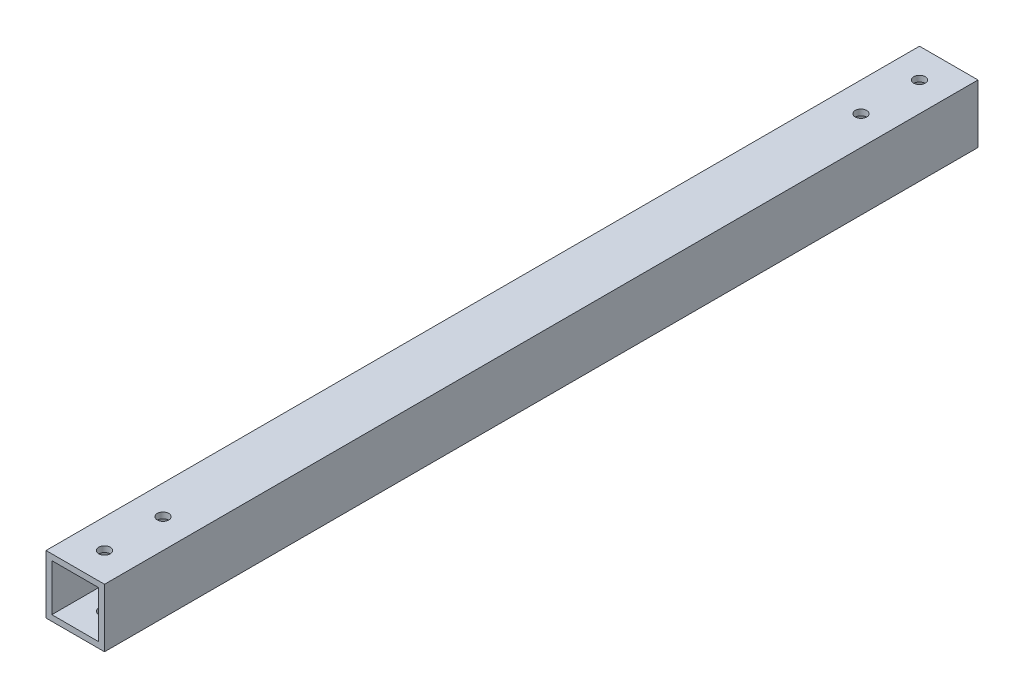
ISO-10303-21;
HEADER;
FILE_DESCRIPTION(('STEP AP214'),'2;1');
FILE_NAME('part.step','',(''),(''),'','','');
FILE_SCHEMA(('AUTOMOTIVE_DESIGN { 1 0 10303 214 1 1 1 1 }'));
ENDSEC;
DATA;
#1=APPLICATION_CONTEXT('core data for automotive mechanical design processes');
#2=APPLICATION_PROTOCOL_DEFINITION('international standard','automotive_design',2000,#1);
#3=PRODUCT_CONTEXT('',#1,'mechanical');
#4=PRODUCT('Part','Part','',(#3));
#5=PRODUCT_RELATED_PRODUCT_CATEGORY('part','',(#4));
#6=PRODUCT_DEFINITION_FORMATION('','',#4);
#7=PRODUCT_DEFINITION_CONTEXT('part definition',#1,'design');
#8=PRODUCT_DEFINITION('design','',#6,#7);
#9=PRODUCT_DEFINITION_SHAPE('','',#8);
#10=(LENGTH_UNIT() NAMED_UNIT(*) SI_UNIT(.MILLI.,.METRE.));
#11=(NAMED_UNIT(*) PLANE_ANGLE_UNIT() SI_UNIT($,.RADIAN.));
#12=(NAMED_UNIT(*) SI_UNIT($,.STERADIAN.) SOLID_ANGLE_UNIT());
#13=UNCERTAINTY_MEASURE_WITH_UNIT(LENGTH_MEASURE(1.E-05),#10,'distance_accuracy_value','');
#14=(GEOMETRIC_REPRESENTATION_CONTEXT(3) GLOBAL_UNCERTAINTY_ASSIGNED_CONTEXT((#13)) GLOBAL_UNIT_ASSIGNED_CONTEXT((#10,
#11,#12)) REPRESENTATION_CONTEXT('',''));
#15=CARTESIAN_POINT('',(0.,0.,0.));
#16=DIRECTION('',(0.,0.,1.));
#17=DIRECTION('',(1.,0.,0.));
#18=AXIS2_PLACEMENT_3D('',#15,#16,#17);
#19=CARTESIAN_POINT('',(0.,0.,189.58179));
#20=DIRECTION('',(0.,0.,1.));
#21=DIRECTION('',(1.,0.,0.));
#22=AXIS2_PLACEMENT_3D('',#19,#20,#21);
#23=PLANE('',#22);
#24=DIRECTION('',(0.,-1.,0.));
#25=VECTOR('',#24,1.);
#26=CARTESIAN_POINT('',(0.,0.,189.58179));
#27=LINE('',#26,#25);
#28=CARTESIAN_POINT('',(0.,25.4,189.58179));
#29=VERTEX_POINT('',#28);
#30=CARTESIAN_POINT('',(0.,0.,189.58179));
#31=VERTEX_POINT('',#30);
#32=EDGE_CURVE('E181',#29,#31,#27,.T.);
#33=ORIENTED_EDGE('',*,*,#32,.T.);
#34=DIRECTION('',(1.,0.,0.));
#35=VECTOR('',#34,1.);
#36=CARTESIAN_POINT('',(0.,0.,189.58179));
#37=LINE('',#36,#35);
#38=CARTESIAN_POINT('',(25.4,0.,189.58179));
#39=VERTEX_POINT('',#38);
#40=EDGE_CURVE('E185',#31,#39,#37,.T.);
#41=ORIENTED_EDGE('',*,*,#40,.T.);
#42=DIRECTION('',(0.,1.,0.));
#43=VECTOR('',#42,1.);
#44=CARTESIAN_POINT('',(25.4,0.,189.58179));
#45=LINE('',#44,#43);
#46=CARTESIAN_POINT('',(25.4,25.4,189.58179));
#47=VERTEX_POINT('',#46);
#48=EDGE_CURVE('E189',#39,#47,#45,.T.);
#49=ORIENTED_EDGE('',*,*,#48,.T.);
#50=DIRECTION('',(-1.,0.,0.));
#51=VECTOR('',#50,1.);
#52=CARTESIAN_POINT('',(0.,25.4,189.58179));
#53=LINE('',#52,#51);
#54=EDGE_CURVE('E192',#47,#29,#53,.T.);
#55=ORIENTED_EDGE('',*,*,#54,.T.);
#56=EDGE_LOOP('',(#33,#41,#49,#55));
#57=FACE_BOUND('',#56,.T.);
#58=DIRECTION('',(1.,0.,0.));
#59=VECTOR('',#58,1.);
#60=CARTESIAN_POINT('',(0.,2.54,189.58179));
#61=LINE('',#60,#59);
#62=CARTESIAN_POINT('',(2.54,2.54,189.58179));
#63=VERTEX_POINT('',#62);
#64=CARTESIAN_POINT('',(22.86,2.54,189.58179));
#65=VERTEX_POINT('',#64);
#66=EDGE_CURVE('E140',#63,#65,#61,.T.);
#67=ORIENTED_EDGE('',*,*,#66,.F.);
#68=DIRECTION('',(0.,-1.,0.));
#69=VECTOR('',#68,1.);
#70=CARTESIAN_POINT('',(2.54,0.,189.58179));
#71=LINE('',#70,#69);
#72=CARTESIAN_POINT('',(2.54,22.86,189.58179));
#73=VERTEX_POINT('',#72);
#74=EDGE_CURVE('E131',#73,#63,#71,.T.);
#75=ORIENTED_EDGE('',*,*,#74,.F.);
#76=DIRECTION('',(-1.,0.,0.));
#77=VECTOR('',#76,1.);
#78=CARTESIAN_POINT('',(0.,22.86,189.58179));
#79=LINE('',#78,#77);
#80=CARTESIAN_POINT('',(22.86,22.86,189.58179));
#81=VERTEX_POINT('',#80);
#82=EDGE_CURVE('E157',#81,#73,#79,.T.);
#83=ORIENTED_EDGE('',*,*,#82,.F.);
#84=DIRECTION('',(0.,1.,0.));
#85=VECTOR('',#84,1.);
#86=CARTESIAN_POINT('',(22.86,0.,189.58179));
#87=LINE('',#86,#85);
#88=EDGE_CURVE('E153',#65,#81,#87,.T.);
#89=ORIENTED_EDGE('',*,*,#88,.F.);
#90=EDGE_LOOP('',(#67,#75,#83,#89));
#91=FACE_BOUND('',#90,.T.);
#92=ADVANCED_FACE('F63',(#57,#91),#23,.T.);
#93=CARTESIAN_POINT('',(0.,0.,-189.58179));
#94=DIRECTION('',(0.,0.,1.));
#95=DIRECTION('',(1.,0.,0.));
#96=AXIS2_PLACEMENT_3D('',#93,#94,#95);
#97=PLANE('',#96);
#98=DIRECTION('',(0.,-1.,0.));
#99=VECTOR('',#98,1.);
#100=CARTESIAN_POINT('',(0.,0.,-189.58179));
#101=LINE('',#100,#99);
#102=CARTESIAN_POINT('',(0.,25.4,-189.58179));
#103=VERTEX_POINT('',#102);
#104=CARTESIAN_POINT('',(0.,0.,-189.58179));
#105=VERTEX_POINT('',#104);
#106=EDGE_CURVE('E149',#103,#105,#101,.T.);
#107=ORIENTED_EDGE('',*,*,#106,.F.);
#108=DIRECTION('',(-1.,0.,0.));
#109=VECTOR('',#108,1.);
#110=CARTESIAN_POINT('',(0.,25.4,-189.58179));
#111=LINE('',#110,#109);
#112=CARTESIAN_POINT('',(25.4,25.4,-189.58179));
#113=VERTEX_POINT('',#112);
#114=EDGE_CURVE('E186',#113,#103,#111,.T.);
#115=ORIENTED_EDGE('',*,*,#114,.F.);
#116=DIRECTION('',(0.,1.,0.));
#117=VECTOR('',#116,1.);
#118=CARTESIAN_POINT('',(25.4,0.,-189.58179));
#119=LINE('',#118,#117);
#120=CARTESIAN_POINT('',(25.4,0.,-189.58179));
#121=VERTEX_POINT('',#120);
#122=EDGE_CURVE('E202',#121,#113,#119,.T.);
#123=ORIENTED_EDGE('',*,*,#122,.F.);
#124=DIRECTION('',(1.,0.,0.));
#125=VECTOR('',#124,1.);
#126=CARTESIAN_POINT('',(0.,0.,-189.58179));
#127=LINE('',#126,#125);
#128=EDGE_CURVE('E199',#105,#121,#127,.T.);
#129=ORIENTED_EDGE('',*,*,#128,.F.);
#130=EDGE_LOOP('',(#107,#115,#123,#129));
#131=FACE_BOUND('',#130,.T.);
#132=DIRECTION('',(0.,-1.,0.));
#133=VECTOR('',#132,1.);
#134=CARTESIAN_POINT('',(2.54,0.,-189.58179));
#135=LINE('',#134,#133);
#136=CARTESIAN_POINT('',(2.54,22.86,-189.58179));
#137=VERTEX_POINT('',#136);
#138=CARTESIAN_POINT('',(2.54,2.54,-189.58179));
#139=VERTEX_POINT('',#138);
#140=EDGE_CURVE('E89',#137,#139,#135,.T.);
#141=ORIENTED_EDGE('',*,*,#140,.T.);
#142=DIRECTION('',(1.,0.,0.));
#143=VECTOR('',#142,1.);
#144=CARTESIAN_POINT('',(0.,2.54,-189.58179));
#145=LINE('',#144,#143);
#146=CARTESIAN_POINT('',(22.86,2.54,-189.58179));
#147=VERTEX_POINT('',#146);
#148=EDGE_CURVE('E147',#139,#147,#145,.T.);
#149=ORIENTED_EDGE('',*,*,#148,.T.);
#150=DIRECTION('',(0.,1.,0.));
#151=VECTOR('',#150,1.);
#152=CARTESIAN_POINT('',(22.86,0.,-189.58179));
#153=LINE('',#152,#151);
#154=CARTESIAN_POINT('',(22.86,22.86,-189.58179));
#155=VERTEX_POINT('',#154);
#156=EDGE_CURVE('E168',#147,#155,#153,.T.);
#157=ORIENTED_EDGE('',*,*,#156,.T.);
#158=DIRECTION('',(-1.,0.,0.));
#159=VECTOR('',#158,1.);
#160=CARTESIAN_POINT('',(0.,22.86,-189.58179));
#161=LINE('',#160,#159);
#162=EDGE_CURVE('E141',#155,#137,#161,.T.);
#163=ORIENTED_EDGE('',*,*,#162,.T.);
#164=EDGE_LOOP('',(#141,#149,#157,#163));
#165=FACE_BOUND('',#164,.T.);
#166=ADVANCED_FACE('F266',(#131,#165),#97,.F.);
#167=CARTESIAN_POINT('',(0.,0.,189.58179));
#168=DIRECTION('',(1.,0.,0.));
#169=DIRECTION('',(0.,0.,-1.));
#170=AXIS2_PLACEMENT_3D('',#167,#168,#169);
#171=PLANE('',#170);
#172=ORIENTED_EDGE('',*,*,#106,.T.);
#173=DIRECTION('',(0.,0.,-1.));
#174=VECTOR('',#173,1.);
#175=CARTESIAN_POINT('',(0.,0.,189.58179));
#176=LINE('',#175,#174);
#177=EDGE_CURVE('E12',#31,#105,#176,.T.);
#178=ORIENTED_EDGE('',*,*,#177,.F.);
#179=ORIENTED_EDGE('',*,*,#32,.F.);
#180=DIRECTION('',(0.,0.,-1.));
#181=VECTOR('',#180,1.);
#182=CARTESIAN_POINT('',(0.,25.4,189.58179));
#183=LINE('',#182,#181);
#184=EDGE_CURVE('E195',#29,#103,#183,.T.);
#185=ORIENTED_EDGE('',*,*,#184,.T.);
#186=EDGE_LOOP('',(#172,#178,#179,#185));
#187=FACE_BOUND('',#186,.T.);
#188=ADVANCED_FACE('F65',(#187),#171,.F.);
#189=CARTESIAN_POINT('',(0.,0.,189.58179));
#190=DIRECTION('',(0.,1.,0.));
#191=DIRECTION('',(0.,0.,1.));
#192=AXIS2_PLACEMENT_3D('',#189,#190,#191);
#193=PLANE('',#192);
#194=CARTESIAN_POINT('',(12.7,0.,176.88179));
#195=DIRECTION('',(0.,1.,0.));
#196=DIRECTION('',(0.,0.,1.));
#197=AXIS2_PLACEMENT_3D('',#194,#195,#196);
#198=CIRCLE('',#197,2.48920000000001);
#199=CARTESIAN_POINT('',(12.7,0.,179.37099));
#200=VERTEX_POINT('',#199);
#201=EDGE_CURVE('E222',#200,#200,#198,.T.);
#202=ORIENTED_EDGE('',*,*,#201,.T.);
#203=EDGE_LOOP('',(#202));
#204=FACE_BOUND('',#203,.T.);
#205=CARTESIAN_POINT('',(12.7,0.,-151.48179));
#206=DIRECTION('',(0.,1.,0.));
#207=DIRECTION('',(0.,0.,-1.));
#208=AXIS2_PLACEMENT_3D('',#205,#206,#207);
#209=CIRCLE('',#208,2.48920000000001);
#210=CARTESIAN_POINT('',(12.7,0.,-153.97099));
#211=VERTEX_POINT('',#210);
#212=EDGE_CURVE('E305',#211,#211,#209,.T.);
#213=ORIENTED_EDGE('',*,*,#212,.T.);
#214=EDGE_LOOP('',(#213));
#215=FACE_BOUND('',#214,.T.);
#216=CARTESIAN_POINT('',(12.7,0.,-176.88179));
#217=DIRECTION('',(0.,1.,0.));
#218=DIRECTION('',(0.,0.,-1.));
#219=AXIS2_PLACEMENT_3D('',#216,#217,#218);
#220=CIRCLE('',#219,2.48920000000001);
#221=CARTESIAN_POINT('',(12.7,0.,-179.37099));
#222=VERTEX_POINT('',#221);
#223=EDGE_CURVE('E309',#222,#222,#220,.T.);
#224=ORIENTED_EDGE('',*,*,#223,.T.);
#225=EDGE_LOOP('',(#224));
#226=FACE_BOUND('',#225,.T.);
#227=CARTESIAN_POINT('',(12.7,0.,151.48179));
#228=DIRECTION('',(0.,1.,0.));
#229=DIRECTION('',(0.,0.,1.));
#230=AXIS2_PLACEMENT_3D('',#227,#228,#229);
#231=CIRCLE('',#230,2.48920000000001);
#232=CARTESIAN_POINT('',(12.7,0.,153.97099));
#233=VERTEX_POINT('',#232);
#234=EDGE_CURVE('E313',#233,#233,#231,.T.);
#235=ORIENTED_EDGE('',*,*,#234,.T.);
#236=EDGE_LOOP('',(#235));
#237=FACE_BOUND('',#236,.T.);
#238=ORIENTED_EDGE('',*,*,#128,.T.);
#239=DIRECTION('',(0.,0.,-1.));
#240=VECTOR('',#239,1.);
#241=CARTESIAN_POINT('',(25.4,0.,189.58179));
#242=LINE('',#241,#240);
#243=EDGE_CURVE('E73',#39,#121,#242,.T.);
#244=ORIENTED_EDGE('',*,*,#243,.F.);
#245=ORIENTED_EDGE('',*,*,#40,.F.);
#246=ORIENTED_EDGE('',*,*,#177,.T.);
#247=EDGE_LOOP('',(#238,#244,#245,#246));
#248=FACE_BOUND('',#247,.T.);
#249=ADVANCED_FACE('F291',(#204,#215,#226,#237,#248),#193,.F.);
#250=CARTESIAN_POINT('',(25.4,0.,189.58179));
#251=DIRECTION('',(-1.,0.,0.));
#252=DIRECTION('',(0.,0.,1.));
#253=AXIS2_PLACEMENT_3D('',#250,#251,#252);
#254=PLANE('',#253);
#255=ORIENTED_EDGE('',*,*,#122,.T.);
#256=DIRECTION('',(0.,0.,-1.));
#257=VECTOR('',#256,1.);
#258=CARTESIAN_POINT('',(25.4,25.4,189.58179));
#259=LINE('',#258,#257);
#260=EDGE_CURVE('E210',#47,#113,#259,.T.);
#261=ORIENTED_EDGE('',*,*,#260,.F.);
#262=ORIENTED_EDGE('',*,*,#48,.F.);
#263=ORIENTED_EDGE('',*,*,#243,.T.);
#264=EDGE_LOOP('',(#255,#261,#262,#263));
#265=FACE_BOUND('',#264,.T.);
#266=ADVANCED_FACE('F288',(#265),#254,.F.);
#267=CARTESIAN_POINT('',(0.,25.4,189.58179));
#268=DIRECTION('',(0.,-1.,0.));
#269=DIRECTION('',(0.,0.,-1.));
#270=AXIS2_PLACEMENT_3D('',#267,#268,#269);
#271=PLANE('',#270);
#272=CARTESIAN_POINT('',(12.7,25.4,176.88179));
#273=DIRECTION('',(0.,1.,0.));
#274=DIRECTION('',(0.,0.,1.));
#275=AXIS2_PLACEMENT_3D('',#272,#273,#274);
#276=CIRCLE('',#275,2.48920000000001);
#277=CARTESIAN_POINT('',(12.7,25.4,179.37099));
#278=VERTEX_POINT('',#277);
#279=EDGE_CURVE('E327',#278,#278,#276,.T.);
#280=ORIENTED_EDGE('',*,*,#279,.F.);
#281=EDGE_LOOP('',(#280));
#282=FACE_BOUND('',#281,.T.);
#283=CARTESIAN_POINT('',(12.7,25.4,-151.48179));
#284=DIRECTION('',(0.,1.,0.));
#285=DIRECTION('',(0.,0.,-1.));
#286=AXIS2_PLACEMENT_3D('',#283,#284,#285);
#287=CIRCLE('',#286,2.48920000000001);
#288=CARTESIAN_POINT('',(12.7,25.4,-153.97099));
#289=VERTEX_POINT('',#288);
#290=EDGE_CURVE('E337',#289,#289,#287,.T.);
#291=ORIENTED_EDGE('',*,*,#290,.F.);
#292=EDGE_LOOP('',(#291));
#293=FACE_BOUND('',#292,.T.);
#294=CARTESIAN_POINT('',(12.7,25.4,-176.88179));
#295=DIRECTION('',(0.,1.,0.));
#296=DIRECTION('',(0.,0.,-1.));
#297=AXIS2_PLACEMENT_3D('',#294,#295,#296);
#298=CIRCLE('',#297,2.48920000000001);
#299=CARTESIAN_POINT('',(12.7,25.4,-179.37099));
#300=VERTEX_POINT('',#299);
#301=EDGE_CURVE('E341',#300,#300,#298,.T.);
#302=ORIENTED_EDGE('',*,*,#301,.F.);
#303=EDGE_LOOP('',(#302));
#304=FACE_BOUND('',#303,.T.);
#305=CARTESIAN_POINT('',(12.7,25.4,151.48179));
#306=DIRECTION('',(0.,1.,0.));
#307=DIRECTION('',(0.,0.,1.));
#308=AXIS2_PLACEMENT_3D('',#305,#306,#307);
#309=CIRCLE('',#308,2.48920000000001);
#310=CARTESIAN_POINT('',(12.7,25.4,153.97099));
#311=VERTEX_POINT('',#310);
#312=EDGE_CURVE('E328',#311,#311,#309,.T.);
#313=ORIENTED_EDGE('',*,*,#312,.F.);
#314=EDGE_LOOP('',(#313));
#315=FACE_BOUND('',#314,.T.);
#316=ORIENTED_EDGE('',*,*,#114,.T.);
#317=ORIENTED_EDGE('',*,*,#184,.F.);
#318=ORIENTED_EDGE('',*,*,#54,.F.);
#319=ORIENTED_EDGE('',*,*,#260,.T.);
#320=EDGE_LOOP('',(#316,#317,#318,#319));
#321=FACE_BOUND('',#320,.T.);
#322=ADVANCED_FACE('F285',(#282,#293,#304,#315,#321),#271,.F.);
#323=CARTESIAN_POINT('',(2.54,0.,189.58179));
#324=DIRECTION('',(1.,0.,0.));
#325=DIRECTION('',(0.,0.,-1.));
#326=AXIS2_PLACEMENT_3D('',#323,#324,#325);
#327=PLANE('',#326);
#328=ORIENTED_EDGE('',*,*,#140,.F.);
#329=DIRECTION('',(0.,0.,-1.));
#330=VECTOR('',#329,1.);
#331=CARTESIAN_POINT('',(2.54,22.86,189.58179));
#332=LINE('',#331,#330);
#333=EDGE_CURVE('E135',#73,#137,#332,.T.);
#334=ORIENTED_EDGE('',*,*,#333,.F.);
#335=ORIENTED_EDGE('',*,*,#74,.T.);
#336=DIRECTION('',(0.,0.,-1.));
#337=VECTOR('',#336,1.);
#338=CARTESIAN_POINT('',(2.54,2.54,189.58179));
#339=LINE('',#338,#337);
#340=EDGE_CURVE('E134',#63,#139,#339,.T.);
#341=ORIENTED_EDGE('',*,*,#340,.T.);
#342=EDGE_LOOP('',(#328,#334,#335,#341));
#343=FACE_BOUND('',#342,.T.);
#344=ADVANCED_FACE('F133',(#343),#327,.T.);
#345=CARTESIAN_POINT('',(0.,2.54,189.58179));
#346=DIRECTION('',(0.,1.,0.));
#347=DIRECTION('',(0.,0.,1.));
#348=AXIS2_PLACEMENT_3D('',#345,#346,#347);
#349=PLANE('',#348);
#350=CARTESIAN_POINT('',(12.7,2.54,176.88179));
#351=DIRECTION('',(0.,1.,0.));
#352=DIRECTION('',(0.,0.,1.));
#353=AXIS2_PLACEMENT_3D('',#350,#351,#352);
#354=CIRCLE('',#353,2.48920000000001);
#355=CARTESIAN_POINT('',(12.7,2.54,179.37099));
#356=VERTEX_POINT('',#355);
#357=EDGE_CURVE('E165',#356,#356,#354,.T.);
#358=ORIENTED_EDGE('',*,*,#357,.F.);
#359=EDGE_LOOP('',(#358));
#360=FACE_BOUND('',#359,.T.);
#361=CARTESIAN_POINT('',(12.7,2.54,-151.48179));
#362=DIRECTION('',(0.,1.,0.));
#363=DIRECTION('',(0.,0.,1.));
#364=AXIS2_PLACEMENT_3D('',#361,#362,#363);
#365=CIRCLE('',#364,2.48920000000001);
#366=CARTESIAN_POINT('',(12.7,2.54,-148.99259));
#367=VERTEX_POINT('',#366);
#368=EDGE_CURVE('E230',#367,#367,#365,.T.);
#369=ORIENTED_EDGE('',*,*,#368,.F.);
#370=EDGE_LOOP('',(#369));
#371=FACE_BOUND('',#370,.T.);
#372=CARTESIAN_POINT('',(12.7,2.54,-176.88179));
#373=DIRECTION('',(0.,1.,0.));
#374=DIRECTION('',(0.,0.,1.));
#375=AXIS2_PLACEMENT_3D('',#372,#373,#374);
#376=CIRCLE('',#375,2.48920000000001);
#377=CARTESIAN_POINT('',(12.7,2.54,-174.39259));
#378=VERTEX_POINT('',#377);
#379=EDGE_CURVE('E226',#378,#378,#376,.T.);
#380=ORIENTED_EDGE('',*,*,#379,.F.);
#381=EDGE_LOOP('',(#380));
#382=FACE_BOUND('',#381,.T.);
#383=CARTESIAN_POINT('',(12.7,2.54,151.48179));
#384=DIRECTION('',(0.,1.,0.));
#385=DIRECTION('',(0.,0.,1.));
#386=AXIS2_PLACEMENT_3D('',#383,#384,#385);
#387=CIRCLE('',#386,2.48920000000001);
#388=CARTESIAN_POINT('',(12.7,2.54,153.97099));
#389=VERTEX_POINT('',#388);
#390=EDGE_CURVE('E221',#389,#389,#387,.T.);
#391=ORIENTED_EDGE('',*,*,#390,.F.);
#392=EDGE_LOOP('',(#391));
#393=FACE_BOUND('',#392,.T.);
#394=ORIENTED_EDGE('',*,*,#148,.F.);
#395=ORIENTED_EDGE('',*,*,#340,.F.);
#396=ORIENTED_EDGE('',*,*,#66,.T.);
#397=DIRECTION('',(0.,0.,-1.));
#398=VECTOR('',#397,1.);
#399=CARTESIAN_POINT('',(22.86,2.54,189.58179));
#400=LINE('',#399,#398);
#401=EDGE_CURVE('E150',#65,#147,#400,.T.);
#402=ORIENTED_EDGE('',*,*,#401,.T.);
#403=EDGE_LOOP('',(#394,#395,#396,#402));
#404=FACE_BOUND('',#403,.T.);
#405=ADVANCED_FACE('F144',(#360,#371,#382,#393,#404),#349,.T.);
#406=CARTESIAN_POINT('',(22.86,0.,189.58179));
#407=DIRECTION('',(-1.,0.,0.));
#408=DIRECTION('',(0.,0.,1.));
#409=AXIS2_PLACEMENT_3D('',#406,#407,#408);
#410=PLANE('',#409);
#411=ORIENTED_EDGE('',*,*,#156,.F.);
#412=ORIENTED_EDGE('',*,*,#401,.F.);
#413=ORIENTED_EDGE('',*,*,#88,.T.);
#414=DIRECTION('',(0.,0.,-1.));
#415=VECTOR('',#414,1.);
#416=CARTESIAN_POINT('',(22.86,22.86,189.58179));
#417=LINE('',#416,#415);
#418=EDGE_CURVE('E81',#81,#155,#417,.T.);
#419=ORIENTED_EDGE('',*,*,#418,.T.);
#420=EDGE_LOOP('',(#411,#412,#413,#419));
#421=FACE_BOUND('',#420,.T.);
#422=ADVANCED_FACE('F258',(#421),#410,.T.);
#423=CARTESIAN_POINT('',(0.,22.86,189.58179));
#424=DIRECTION('',(0.,-1.,0.));
#425=DIRECTION('',(0.,0.,-1.));
#426=AXIS2_PLACEMENT_3D('',#423,#424,#425);
#427=PLANE('',#426);
#428=CARTESIAN_POINT('',(12.7,22.86,176.88179));
#429=DIRECTION('',(0.,-1.,0.));
#430=DIRECTION('',(0.,0.,-1.));
#431=AXIS2_PLACEMENT_3D('',#428,#429,#430);
#432=CIRCLE('',#431,2.48920000000001);
#433=CARTESIAN_POINT('',(12.7,22.86,174.39259));
#434=VERTEX_POINT('',#433);
#435=EDGE_CURVE('E67',#434,#434,#432,.T.);
#436=ORIENTED_EDGE('',*,*,#435,.F.);
#437=EDGE_LOOP('',(#436));
#438=FACE_BOUND('',#437,.T.);
#439=CARTESIAN_POINT('',(12.7,22.86,-151.48179));
#440=DIRECTION('',(0.,-1.,0.));
#441=DIRECTION('',(0.,0.,-1.));
#442=AXIS2_PLACEMENT_3D('',#439,#440,#441);
#443=CIRCLE('',#442,2.48920000000001);
#444=CARTESIAN_POINT('',(12.7,22.86,-153.97099));
#445=VERTEX_POINT('',#444);
#446=EDGE_CURVE('E227',#445,#445,#443,.T.);
#447=ORIENTED_EDGE('',*,*,#446,.F.);
#448=EDGE_LOOP('',(#447));
#449=FACE_BOUND('',#448,.T.);
#450=CARTESIAN_POINT('',(12.7,22.86,-176.88179));
#451=DIRECTION('',(0.,-1.,0.));
#452=DIRECTION('',(0.,0.,-1.));
#453=AXIS2_PLACEMENT_3D('',#450,#451,#452);
#454=CIRCLE('',#453,2.48920000000001);
#455=CARTESIAN_POINT('',(12.7,22.86,-179.37099));
#456=VERTEX_POINT('',#455);
#457=EDGE_CURVE('E223',#456,#456,#454,.T.);
#458=ORIENTED_EDGE('',*,*,#457,.F.);
#459=EDGE_LOOP('',(#458));
#460=FACE_BOUND('',#459,.T.);
#461=CARTESIAN_POINT('',(12.7,22.86,151.48179));
#462=DIRECTION('',(0.,-1.,0.));
#463=DIRECTION('',(0.,0.,-1.));
#464=AXIS2_PLACEMENT_3D('',#461,#462,#463);
#465=CIRCLE('',#464,2.48920000000001);
#466=CARTESIAN_POINT('',(12.7,22.86,148.99259));
#467=VERTEX_POINT('',#466);
#468=EDGE_CURVE('E217',#467,#467,#465,.T.);
#469=ORIENTED_EDGE('',*,*,#468,.F.);
#470=EDGE_LOOP('',(#469));
#471=FACE_BOUND('',#470,.T.);
#472=ORIENTED_EDGE('',*,*,#162,.F.);
#473=ORIENTED_EDGE('',*,*,#418,.F.);
#474=ORIENTED_EDGE('',*,*,#82,.T.);
#475=ORIENTED_EDGE('',*,*,#333,.T.);
#476=EDGE_LOOP('',(#472,#473,#474,#475));
#477=FACE_BOUND('',#476,.T.);
#478=ADVANCED_FACE('F254',(#438,#449,#460,#471,#477),#427,.T.);
#479=CARTESIAN_POINT('',(12.7,0.,151.48179));
#480=DIRECTION('',(0.,1.,0.));
#481=DIRECTION('',(0.,0.,1.));
#482=AXIS2_PLACEMENT_3D('',#479,#480,#481);
#483=CYLINDRICAL_SURFACE('',#482,2.48920000000001);
#484=ORIENTED_EDGE('',*,*,#468,.T.);
#485=EDGE_LOOP('',(#484));
#486=FACE_BOUND('',#485,.T.);
#487=ORIENTED_EDGE('',*,*,#312,.T.);
#488=EDGE_LOOP('',(#487));
#489=FACE_BOUND('',#488,.T.);
#490=ADVANCED_FACE('F257',(#486,#489),#483,.F.);
#491=CARTESIAN_POINT('',(12.7,0.,-176.88179));
#492=DIRECTION('',(0.,1.,0.));
#493=DIRECTION('',(0.,0.,1.));
#494=AXIS2_PLACEMENT_3D('',#491,#492,#493);
#495=CYLINDRICAL_SURFACE('',#494,2.48920000000001);
#496=ORIENTED_EDGE('',*,*,#457,.T.);
#497=EDGE_LOOP('',(#496));
#498=FACE_BOUND('',#497,.T.);
#499=ORIENTED_EDGE('',*,*,#301,.T.);
#500=EDGE_LOOP('',(#499));
#501=FACE_BOUND('',#500,.T.);
#502=ADVANCED_FACE('F366',(#498,#501),#495,.F.);
#503=CARTESIAN_POINT('',(12.7,0.,-151.48179));
#504=DIRECTION('',(0.,1.,0.));
#505=DIRECTION('',(0.,0.,1.));
#506=AXIS2_PLACEMENT_3D('',#503,#504,#505);
#507=CYLINDRICAL_SURFACE('',#506,2.48920000000001);
#508=ORIENTED_EDGE('',*,*,#446,.T.);
#509=EDGE_LOOP('',(#508));
#510=FACE_BOUND('',#509,.T.);
#511=ORIENTED_EDGE('',*,*,#290,.T.);
#512=EDGE_LOOP('',(#511));
#513=FACE_BOUND('',#512,.T.);
#514=ADVANCED_FACE('F367',(#510,#513),#507,.F.);
#515=CARTESIAN_POINT('',(12.7,0.,176.88179));
#516=DIRECTION('',(0.,1.,0.));
#517=DIRECTION('',(0.,0.,1.));
#518=AXIS2_PLACEMENT_3D('',#515,#516,#517);
#519=CYLINDRICAL_SURFACE('',#518,2.48920000000001);
#520=ORIENTED_EDGE('',*,*,#435,.T.);
#521=EDGE_LOOP('',(#520));
#522=FACE_BOUND('',#521,.T.);
#523=ORIENTED_EDGE('',*,*,#279,.T.);
#524=EDGE_LOOP('',(#523));
#525=FACE_BOUND('',#524,.T.);
#526=ADVANCED_FACE('F251',(#522,#525),#519,.F.);
#527=ORIENTED_EDGE('',*,*,#390,.T.);
#528=EDGE_LOOP('',(#527));
#529=FACE_BOUND('',#528,.T.);
#530=ORIENTED_EDGE('',*,*,#234,.F.);
#531=EDGE_LOOP('',(#530));
#532=FACE_BOUND('',#531,.T.);
#533=ADVANCED_FACE('F355',(#529,#532),#483,.F.);
#534=ORIENTED_EDGE('',*,*,#379,.T.);
#535=EDGE_LOOP('',(#534));
#536=FACE_BOUND('',#535,.T.);
#537=ORIENTED_EDGE('',*,*,#223,.F.);
#538=EDGE_LOOP('',(#537));
#539=FACE_BOUND('',#538,.T.);
#540=ADVANCED_FACE('F358',(#536,#539),#495,.F.);
#541=ORIENTED_EDGE('',*,*,#368,.T.);
#542=EDGE_LOOP('',(#541));
#543=FACE_BOUND('',#542,.T.);
#544=ORIENTED_EDGE('',*,*,#212,.F.);
#545=EDGE_LOOP('',(#544));
#546=FACE_BOUND('',#545,.T.);
#547=ADVANCED_FACE('F364',(#543,#546),#507,.F.);
#548=ORIENTED_EDGE('',*,*,#357,.T.);
#549=EDGE_LOOP('',(#548));
#550=FACE_BOUND('',#549,.T.);
#551=ORIENTED_EDGE('',*,*,#201,.F.);
#552=EDGE_LOOP('',(#551));
#553=FACE_BOUND('',#552,.T.);
#554=ADVANCED_FACE('F369',(#550,#553),#519,.F.);
#555=CLOSED_SHELL('',(#92,#166,#188,#249,#266,#322,#344,#405,#422,#478,#490,#502,#514,#526,#533,
#540,#547,#554));
#556=MANIFOLD_SOLID_BREP('B2',#555);
#557=ADVANCED_BREP_SHAPE_REPRESENTATION('',(#18,#556),#14);
#558=SHAPE_DEFINITION_REPRESENTATION(#9,#557);
ENDSEC;
END-ISO-10303-21;
